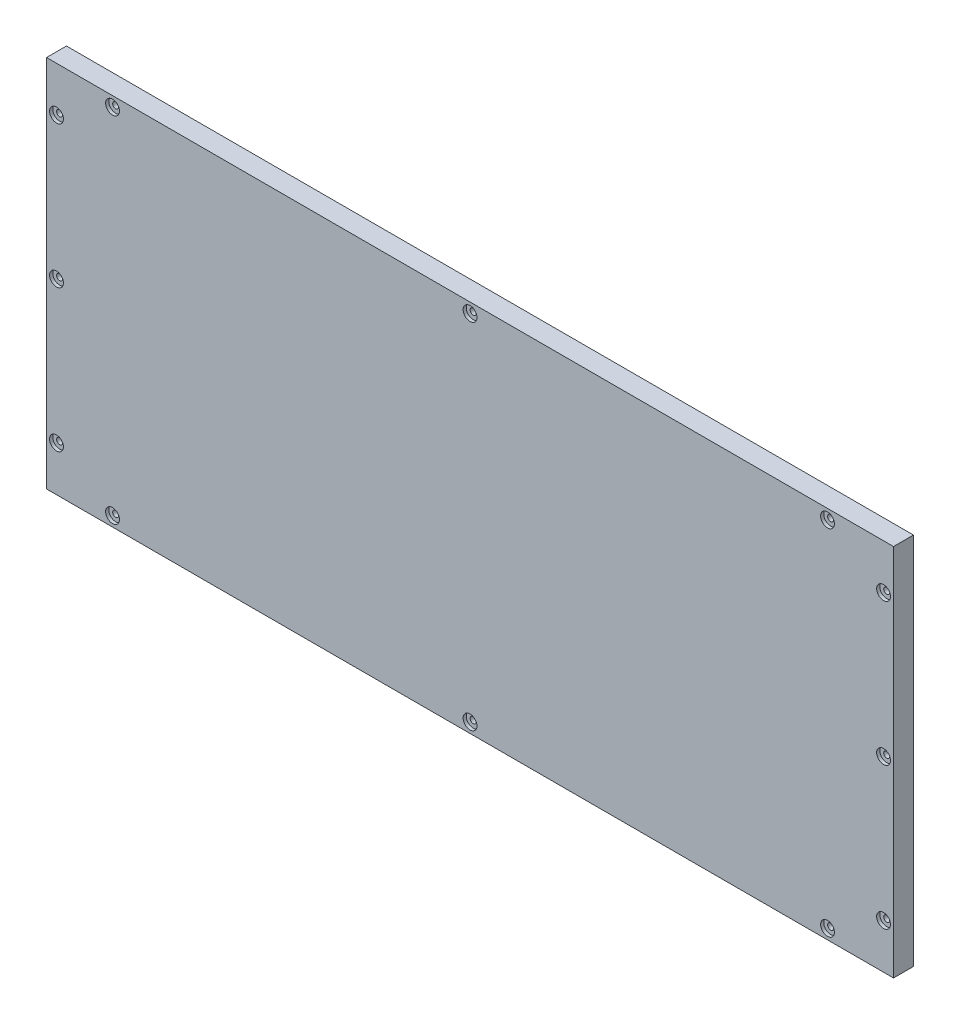
ISO-10303-21;
HEADER;
FILE_DESCRIPTION(('STEP AP214'),'2;1');
FILE_NAME('part.step','',(''),(''),'','','');
FILE_SCHEMA(('AUTOMOTIVE_DESIGN { 1 0 10303 214 1 1 1 1 }'));
ENDSEC;
DATA;
#1=APPLICATION_CONTEXT('core data for automotive mechanical design processes');
#2=APPLICATION_PROTOCOL_DEFINITION('international standard','automotive_design',2000,#1);
#3=PRODUCT_CONTEXT('',#1,'mechanical');
#4=PRODUCT('Part','Part','',(#3));
#5=PRODUCT_RELATED_PRODUCT_CATEGORY('part','',(#4));
#6=PRODUCT_DEFINITION_FORMATION('','',#4);
#7=PRODUCT_DEFINITION_CONTEXT('part definition',#1,'design');
#8=PRODUCT_DEFINITION('design','',#6,#7);
#9=PRODUCT_DEFINITION_SHAPE('','',#8);
#10=(LENGTH_UNIT() NAMED_UNIT(*) SI_UNIT(.MILLI.,.METRE.));
#11=(NAMED_UNIT(*) PLANE_ANGLE_UNIT() SI_UNIT($,.RADIAN.));
#12=(NAMED_UNIT(*) SI_UNIT($,.STERADIAN.) SOLID_ANGLE_UNIT());
#13=UNCERTAINTY_MEASURE_WITH_UNIT(LENGTH_MEASURE(1.E-05),#10,'distance_accuracy_value','');
#14=(GEOMETRIC_REPRESENTATION_CONTEXT(3) GLOBAL_UNCERTAINTY_ASSIGNED_CONTEXT((#13)) GLOBAL_UNIT_ASSIGNED_CONTEXT((#10,
#11,#12)) REPRESENTATION_CONTEXT('',''));
#15=CARTESIAN_POINT('',(0.,0.,0.));
#16=DIRECTION('',(0.,0.,1.));
#17=DIRECTION('',(1.,0.,0.));
#18=AXIS2_PLACEMENT_3D('',#15,#16,#17);
#19=CARTESIAN_POINT('',(0.,0.,8.));
#20=DIRECTION('',(1.,0.,0.));
#21=DIRECTION('',(0.,0.,-1.));
#22=AXIS2_PLACEMENT_3D('',#19,#20,#21);
#23=PLANE('',#22);
#24=DIRECTION('',(0.,-1.,0.));
#25=VECTOR('',#24,1.);
#26=CARTESIAN_POINT('',(0.,0.,0.));
#27=LINE('',#26,#25);
#28=CARTESIAN_POINT('',(0.,150.,0.));
#29=VERTEX_POINT('',#28);
#30=CARTESIAN_POINT('',(0.,0.,0.));
#31=VERTEX_POINT('',#30);
#32=EDGE_CURVE('E99',#29,#31,#27,.T.);
#33=ORIENTED_EDGE('',*,*,#32,.T.);
#34=DIRECTION('',(0.,0.,-1.));
#35=VECTOR('',#34,1.);
#36=CARTESIAN_POINT('',(0.,0.,8.));
#37=LINE('',#36,#35);
#38=CARTESIAN_POINT('',(0.,0.,8.));
#39=VERTEX_POINT('',#38);
#40=EDGE_CURVE('E11',#39,#31,#37,.T.);
#41=ORIENTED_EDGE('',*,*,#40,.F.);
#42=DIRECTION('',(0.,-1.,0.));
#43=VECTOR('',#42,1.);
#44=CARTESIAN_POINT('',(0.,0.,8.));
#45=LINE('',#44,#43);
#46=CARTESIAN_POINT('',(0.,150.,8.));
#47=VERTEX_POINT('',#46);
#48=EDGE_CURVE('E86',#47,#39,#45,.T.);
#49=ORIENTED_EDGE('',*,*,#48,.F.);
#50=DIRECTION('',(0.,0.,-1.));
#51=VECTOR('',#50,1.);
#52=CARTESIAN_POINT('',(0.,150.,8.));
#53=LINE('',#52,#51);
#54=EDGE_CURVE('E95',#47,#29,#53,.T.);
#55=ORIENTED_EDGE('',*,*,#54,.T.);
#56=EDGE_LOOP('',(#33,#41,#49,#55));
#57=FACE_BOUND('',#56,.T.);
#58=ADVANCED_FACE('F33',(#57),#23,.F.);
#59=CARTESIAN_POINT('',(0.,0.,8.));
#60=DIRECTION('',(0.,1.,0.));
#61=DIRECTION('',(0.,0.,1.));
#62=AXIS2_PLACEMENT_3D('',#59,#60,#61);
#63=PLANE('',#62);
#64=DIRECTION('',(1.,0.,0.));
#65=VECTOR('',#64,1.);
#66=CARTESIAN_POINT('',(0.,0.,0.));
#67=LINE('',#66,#65);
#68=CARTESIAN_POINT('',(340.,0.,0.));
#69=VERTEX_POINT('',#68);
#70=EDGE_CURVE('E90',#31,#69,#67,.T.);
#71=ORIENTED_EDGE('',*,*,#70,.T.);
#72=DIRECTION('',(0.,0.,-1.));
#73=VECTOR('',#72,1.);
#74=CARTESIAN_POINT('',(340.,0.,8.));
#75=LINE('',#74,#73);
#76=CARTESIAN_POINT('',(340.,0.,8.));
#77=VERTEX_POINT('',#76);
#78=EDGE_CURVE('E42',#77,#69,#75,.T.);
#79=ORIENTED_EDGE('',*,*,#78,.F.);
#80=DIRECTION('',(1.,0.,0.));
#81=VECTOR('',#80,1.);
#82=CARTESIAN_POINT('',(0.,0.,8.));
#83=LINE('',#82,#81);
#84=EDGE_CURVE('E81',#39,#77,#83,.T.);
#85=ORIENTED_EDGE('',*,*,#84,.F.);
#86=ORIENTED_EDGE('',*,*,#40,.T.);
#87=EDGE_LOOP('',(#71,#79,#85,#86));
#88=FACE_BOUND('',#87,.T.);
#89=ADVANCED_FACE('F89',(#88),#63,.F.);
#90=CARTESIAN_POINT('',(340.,0.,8.));
#91=DIRECTION('',(-1.,0.,0.));
#92=DIRECTION('',(0.,0.,1.));
#93=AXIS2_PLACEMENT_3D('',#90,#91,#92);
#94=PLANE('',#93);
#95=DIRECTION('',(0.,1.,0.));
#96=VECTOR('',#95,1.);
#97=CARTESIAN_POINT('',(340.,0.,0.));
#98=LINE('',#97,#96);
#99=CARTESIAN_POINT('',(340.,150.,0.));
#100=VERTEX_POINT('',#99);
#101=EDGE_CURVE('E68',#69,#100,#98,.T.);
#102=ORIENTED_EDGE('',*,*,#101,.T.);
#103=DIRECTION('',(0.,0.,-1.));
#104=VECTOR('',#103,1.);
#105=CARTESIAN_POINT('',(340.,150.,8.));
#106=LINE('',#105,#104);
#107=CARTESIAN_POINT('',(340.,150.,8.));
#108=VERTEX_POINT('',#107);
#109=EDGE_CURVE('E91',#108,#100,#106,.T.);
#110=ORIENTED_EDGE('',*,*,#109,.F.);
#111=DIRECTION('',(0.,1.,0.));
#112=VECTOR('',#111,1.);
#113=CARTESIAN_POINT('',(340.,0.,8.));
#114=LINE('',#113,#112);
#115=EDGE_CURVE('E84',#77,#108,#114,.T.);
#116=ORIENTED_EDGE('',*,*,#115,.F.);
#117=ORIENTED_EDGE('',*,*,#78,.T.);
#118=EDGE_LOOP('',(#102,#110,#116,#117));
#119=FACE_BOUND('',#118,.T.);
#120=ADVANCED_FACE('F93',(#119),#94,.F.);
#121=CARTESIAN_POINT('',(0.,150.,8.));
#122=DIRECTION('',(0.,-1.,0.));
#123=DIRECTION('',(0.,0.,-1.));
#124=AXIS2_PLACEMENT_3D('',#121,#122,#123);
#125=PLANE('',#124);
#126=DIRECTION('',(-1.,0.,0.));
#127=VECTOR('',#126,1.);
#128=CARTESIAN_POINT('',(0.,150.,0.));
#129=LINE('',#128,#127);
#130=EDGE_CURVE('E74',#100,#29,#129,.T.);
#131=ORIENTED_EDGE('',*,*,#130,.T.);
#132=ORIENTED_EDGE('',*,*,#54,.F.);
#133=DIRECTION('',(-1.,0.,0.));
#134=VECTOR('',#133,1.);
#135=CARTESIAN_POINT('',(0.,150.,8.));
#136=LINE('',#135,#134);
#137=EDGE_CURVE('E51',#108,#47,#136,.T.);
#138=ORIENTED_EDGE('',*,*,#137,.F.);
#139=ORIENTED_EDGE('',*,*,#109,.T.);
#140=EDGE_LOOP('',(#131,#132,#138,#139));
#141=FACE_BOUND('',#140,.T.);
#142=ADVANCED_FACE('F259',(#141),#125,.F.);
#143=CARTESIAN_POINT('',(0.,0.,8.));
#144=DIRECTION('',(0.,0.,-1.));
#145=DIRECTION('',(-1.,0.,0.));
#146=AXIS2_PLACEMENT_3D('',#143,#144,#145);
#147=PLANE('',#146);
#148=CARTESIAN_POINT('',(4.,132.,8.));
#149=DIRECTION('',(0.,0.,1.));
#150=DIRECTION('',(1.,0.,0.));
#151=AXIS2_PLACEMENT_3D('',#148,#149,#150);
#152=CIRCLE('',#151,2.77876);
#153=CARTESIAN_POINT('',(6.77876,132.,8.));
#154=VERTEX_POINT('',#153);
#155=EDGE_CURVE('E656',#154,#154,#152,.T.);
#156=ORIENTED_EDGE('',*,*,#155,.F.);
#157=EDGE_LOOP('',(#156));
#158=FACE_BOUND('',#157,.T.);
#159=CARTESIAN_POINT('',(4.00000000000001,75.,8.));
#160=DIRECTION('',(0.,0.,1.));
#161=DIRECTION('',(1.,0.,0.));
#162=AXIS2_PLACEMENT_3D('',#159,#160,#161);
#163=CIRCLE('',#162,2.77876);
#164=CARTESIAN_POINT('',(6.77876000000001,75.,8.));
#165=VERTEX_POINT('',#164);
#166=EDGE_CURVE('E170',#165,#165,#163,.T.);
#167=ORIENTED_EDGE('',*,*,#166,.F.);
#168=EDGE_LOOP('',(#167));
#169=FACE_BOUND('',#168,.T.);
#170=CARTESIAN_POINT('',(4.,18.,8.));
#171=DIRECTION('',(0.,0.,1.));
#172=DIRECTION('',(1.,0.,0.));
#173=AXIS2_PLACEMENT_3D('',#170,#171,#172);
#174=CIRCLE('',#173,2.77876);
#175=CARTESIAN_POINT('',(6.77876,18.,8.));
#176=VERTEX_POINT('',#175);
#177=EDGE_CURVE('E157',#176,#176,#174,.T.);
#178=ORIENTED_EDGE('',*,*,#177,.F.);
#179=EDGE_LOOP('',(#178));
#180=FACE_BOUND('',#179,.T.);
#181=CARTESIAN_POINT('',(26.5,4.,8.));
#182=DIRECTION('',(0.,0.,1.));
#183=DIRECTION('',(1.,0.,0.));
#184=AXIS2_PLACEMENT_3D('',#181,#182,#183);
#185=CIRCLE('',#184,2.77876);
#186=CARTESIAN_POINT('',(29.27876,4.,8.));
#187=VERTEX_POINT('',#186);
#188=EDGE_CURVE('E153',#187,#187,#185,.T.);
#189=ORIENTED_EDGE('',*,*,#188,.F.);
#190=EDGE_LOOP('',(#189));
#191=FACE_BOUND('',#190,.T.);
#192=CARTESIAN_POINT('',(170.,4.00000000000001,8.));
#193=DIRECTION('',(0.,0.,1.));
#194=DIRECTION('',(1.,0.,0.));
#195=AXIS2_PLACEMENT_3D('',#192,#193,#194);
#196=CIRCLE('',#195,2.77875999999999);
#197=CARTESIAN_POINT('',(172.77876,4.00000000000001,8.));
#198=VERTEX_POINT('',#197);
#199=EDGE_CURVE('E149',#198,#198,#196,.T.);
#200=ORIENTED_EDGE('',*,*,#199,.F.);
#201=EDGE_LOOP('',(#200));
#202=FACE_BOUND('',#201,.T.);
#203=CARTESIAN_POINT('',(313.5,4.,8.));
#204=DIRECTION('',(0.,0.,1.));
#205=DIRECTION('',(1.,0.,0.));
#206=AXIS2_PLACEMENT_3D('',#203,#204,#205);
#207=CIRCLE('',#206,2.77875999999999);
#208=CARTESIAN_POINT('',(316.27876,4.,8.));
#209=VERTEX_POINT('',#208);
#210=EDGE_CURVE('E144',#209,#209,#207,.T.);
#211=ORIENTED_EDGE('',*,*,#210,.F.);
#212=EDGE_LOOP('',(#211));
#213=FACE_BOUND('',#212,.T.);
#214=CARTESIAN_POINT('',(336.,18.,8.));
#215=DIRECTION('',(0.,0.,1.));
#216=DIRECTION('',(1.,0.,0.));
#217=AXIS2_PLACEMENT_3D('',#214,#215,#216);
#218=CIRCLE('',#217,2.77875999999999);
#219=CARTESIAN_POINT('',(338.77876,18.,8.));
#220=VERTEX_POINT('',#219);
#221=EDGE_CURVE('E139',#220,#220,#218,.T.);
#222=ORIENTED_EDGE('',*,*,#221,.F.);
#223=EDGE_LOOP('',(#222));
#224=FACE_BOUND('',#223,.T.);
#225=CARTESIAN_POINT('',(336.,75.,8.));
#226=DIRECTION('',(0.,0.,1.));
#227=DIRECTION('',(1.,0.,0.));
#228=AXIS2_PLACEMENT_3D('',#225,#226,#227);
#229=CIRCLE('',#228,2.77875999999999);
#230=CARTESIAN_POINT('',(338.77876,75.,8.));
#231=VERTEX_POINT('',#230);
#232=EDGE_CURVE('E134',#231,#231,#229,.T.);
#233=ORIENTED_EDGE('',*,*,#232,.F.);
#234=EDGE_LOOP('',(#233));
#235=FACE_BOUND('',#234,.T.);
#236=CARTESIAN_POINT('',(336.,132.,8.));
#237=DIRECTION('',(0.,0.,1.));
#238=DIRECTION('',(1.,0.,0.));
#239=AXIS2_PLACEMENT_3D('',#236,#237,#238);
#240=CIRCLE('',#239,2.77875999999999);
#241=CARTESIAN_POINT('',(338.77876,132.,8.));
#242=VERTEX_POINT('',#241);
#243=EDGE_CURVE('E129',#242,#242,#240,.T.);
#244=ORIENTED_EDGE('',*,*,#243,.F.);
#245=EDGE_LOOP('',(#244));
#246=FACE_BOUND('',#245,.T.);
#247=CARTESIAN_POINT('',(313.5,146.,8.));
#248=DIRECTION('',(0.,0.,1.));
#249=DIRECTION('',(1.,0.,0.));
#250=AXIS2_PLACEMENT_3D('',#247,#248,#249);
#251=CIRCLE('',#250,2.77875999999999);
#252=CARTESIAN_POINT('',(316.27876,146.,8.));
#253=VERTEX_POINT('',#252);
#254=EDGE_CURVE('E124',#253,#253,#251,.T.);
#255=ORIENTED_EDGE('',*,*,#254,.F.);
#256=EDGE_LOOP('',(#255));
#257=FACE_BOUND('',#256,.T.);
#258=CARTESIAN_POINT('',(170.,146.,8.));
#259=DIRECTION('',(0.,0.,1.));
#260=DIRECTION('',(1.,0.,0.));
#261=AXIS2_PLACEMENT_3D('',#258,#259,#260);
#262=CIRCLE('',#261,2.77875999999999);
#263=CARTESIAN_POINT('',(172.77876,146.,8.));
#264=VERTEX_POINT('',#263);
#265=EDGE_CURVE('E119',#264,#264,#262,.T.);
#266=ORIENTED_EDGE('',*,*,#265,.F.);
#267=EDGE_LOOP('',(#266));
#268=FACE_BOUND('',#267,.T.);
#269=CARTESIAN_POINT('',(26.5,146.,8.));
#270=DIRECTION('',(0.,0.,1.));
#271=DIRECTION('',(1.,0.,0.));
#272=AXIS2_PLACEMENT_3D('',#269,#270,#271);
#273=CIRCLE('',#272,2.77876);
#274=CARTESIAN_POINT('',(29.27876,146.,8.));
#275=VERTEX_POINT('',#274);
#276=EDGE_CURVE('E114',#275,#275,#273,.T.);
#277=ORIENTED_EDGE('',*,*,#276,.F.);
#278=EDGE_LOOP('',(#277));
#279=FACE_BOUND('',#278,.T.);
#280=ORIENTED_EDGE('',*,*,#48,.T.);
#281=ORIENTED_EDGE('',*,*,#84,.T.);
#282=ORIENTED_EDGE('',*,*,#115,.T.);
#283=ORIENTED_EDGE('',*,*,#137,.T.);
#284=EDGE_LOOP('',(#280,#281,#282,#283));
#285=FACE_BOUND('',#284,.T.);
#286=ADVANCED_FACE('F82',(#158,#169,#180,#191,#202,#213,#224,#235,#246,#257,#268,#279,#285),
#147,.F.);
#287=CARTESIAN_POINT('',(0.,0.,0.));
#288=DIRECTION('',(0.,0.,-1.));
#289=DIRECTION('',(-1.,0.,0.));
#290=AXIS2_PLACEMENT_3D('',#287,#288,#289);
#291=PLANE('',#290);
#292=CARTESIAN_POINT('',(4.,132.,0.));
#293=DIRECTION('',(0.,0.,-1.));
#294=DIRECTION('',(-1.,0.,0.));
#295=AXIS2_PLACEMENT_3D('',#292,#293,#294);
#296=CIRCLE('',#295,1.2192);
#297=CARTESIAN_POINT('',(2.78080000000001,132.,0.));
#298=VERTEX_POINT('',#297);
#299=EDGE_CURVE('E36',#298,#298,#296,.T.);
#300=ORIENTED_EDGE('',*,*,#299,.F.);
#301=EDGE_LOOP('',(#300));
#302=FACE_BOUND('',#301,.T.);
#303=CARTESIAN_POINT('',(4.00000000000001,75.,0.));
#304=DIRECTION('',(0.,0.,-1.));
#305=DIRECTION('',(-1.,0.,0.));
#306=AXIS2_PLACEMENT_3D('',#303,#304,#305);
#307=CIRCLE('',#306,1.2192);
#308=CARTESIAN_POINT('',(2.78080000000001,75.,0.));
#309=VERTEX_POINT('',#308);
#310=EDGE_CURVE('E155',#309,#309,#307,.T.);
#311=ORIENTED_EDGE('',*,*,#310,.F.);
#312=EDGE_LOOP('',(#311));
#313=FACE_BOUND('',#312,.T.);
#314=CARTESIAN_POINT('',(4.,18.,0.));
#315=DIRECTION('',(0.,0.,-1.));
#316=DIRECTION('',(-1.,0.,0.));
#317=AXIS2_PLACEMENT_3D('',#314,#315,#316);
#318=CIRCLE('',#317,1.2192);
#319=CARTESIAN_POINT('',(2.7808,18.,0.));
#320=VERTEX_POINT('',#319);
#321=EDGE_CURVE('E151',#320,#320,#318,.T.);
#322=ORIENTED_EDGE('',*,*,#321,.F.);
#323=EDGE_LOOP('',(#322));
#324=FACE_BOUND('',#323,.T.);
#325=CARTESIAN_POINT('',(26.5,4.,0.));
#326=DIRECTION('',(0.,0.,-1.));
#327=DIRECTION('',(-1.,0.,0.));
#328=AXIS2_PLACEMENT_3D('',#325,#326,#327);
#329=CIRCLE('',#328,1.2192);
#330=CARTESIAN_POINT('',(25.2808,4.,0.));
#331=VERTEX_POINT('',#330);
#332=EDGE_CURVE('E146',#331,#331,#329,.T.);
#333=ORIENTED_EDGE('',*,*,#332,.F.);
#334=EDGE_LOOP('',(#333));
#335=FACE_BOUND('',#334,.T.);
#336=CARTESIAN_POINT('',(170.,4.00000000000001,0.));
#337=DIRECTION('',(0.,0.,-1.));
#338=DIRECTION('',(-1.,0.,0.));
#339=AXIS2_PLACEMENT_3D('',#336,#337,#338);
#340=CIRCLE('',#339,1.2192);
#341=CARTESIAN_POINT('',(168.7808,4.00000000000001,0.));
#342=VERTEX_POINT('',#341);
#343=EDGE_CURVE('E141',#342,#342,#340,.T.);
#344=ORIENTED_EDGE('',*,*,#343,.F.);
#345=EDGE_LOOP('',(#344));
#346=FACE_BOUND('',#345,.T.);
#347=CARTESIAN_POINT('',(313.5,4.,0.));
#348=DIRECTION('',(0.,0.,-1.));
#349=DIRECTION('',(-1.,0.,0.));
#350=AXIS2_PLACEMENT_3D('',#347,#348,#349);
#351=CIRCLE('',#350,1.21919999999998);
#352=CARTESIAN_POINT('',(312.2808,4.,0.));
#353=VERTEX_POINT('',#352);
#354=EDGE_CURVE('E136',#353,#353,#351,.T.);
#355=ORIENTED_EDGE('',*,*,#354,.F.);
#356=EDGE_LOOP('',(#355));
#357=FACE_BOUND('',#356,.T.);
#358=CARTESIAN_POINT('',(336.,18.,0.));
#359=DIRECTION('',(0.,0.,-1.));
#360=DIRECTION('',(-1.,0.,0.));
#361=AXIS2_PLACEMENT_3D('',#358,#359,#360);
#362=CIRCLE('',#361,1.21919999999998);
#363=CARTESIAN_POINT('',(334.7808,18.,0.));
#364=VERTEX_POINT('',#363);
#365=EDGE_CURVE('E131',#364,#364,#362,.T.);
#366=ORIENTED_EDGE('',*,*,#365,.F.);
#367=EDGE_LOOP('',(#366));
#368=FACE_BOUND('',#367,.T.);
#369=CARTESIAN_POINT('',(336.,75.,0.));
#370=DIRECTION('',(0.,0.,-1.));
#371=DIRECTION('',(-1.,0.,0.));
#372=AXIS2_PLACEMENT_3D('',#369,#370,#371);
#373=CIRCLE('',#372,1.21919999999998);
#374=CARTESIAN_POINT('',(334.7808,75.,0.));
#375=VERTEX_POINT('',#374);
#376=EDGE_CURVE('E126',#375,#375,#373,.T.);
#377=ORIENTED_EDGE('',*,*,#376,.F.);
#378=EDGE_LOOP('',(#377));
#379=FACE_BOUND('',#378,.T.);
#380=CARTESIAN_POINT('',(336.,132.,0.));
#381=DIRECTION('',(0.,0.,-1.));
#382=DIRECTION('',(-1.,0.,0.));
#383=AXIS2_PLACEMENT_3D('',#380,#381,#382);
#384=CIRCLE('',#383,1.21919999999998);
#385=CARTESIAN_POINT('',(334.7808,132.,0.));
#386=VERTEX_POINT('',#385);
#387=EDGE_CURVE('E121',#386,#386,#384,.T.);
#388=ORIENTED_EDGE('',*,*,#387,.F.);
#389=EDGE_LOOP('',(#388));
#390=FACE_BOUND('',#389,.T.);
#391=CARTESIAN_POINT('',(313.5,146.,0.));
#392=DIRECTION('',(0.,0.,-1.));
#393=DIRECTION('',(-1.,0.,0.));
#394=AXIS2_PLACEMENT_3D('',#391,#392,#393);
#395=CIRCLE('',#394,1.21919999999998);
#396=CARTESIAN_POINT('',(312.2808,146.,0.));
#397=VERTEX_POINT('',#396);
#398=EDGE_CURVE('E116',#397,#397,#395,.T.);
#399=ORIENTED_EDGE('',*,*,#398,.F.);
#400=EDGE_LOOP('',(#399));
#401=FACE_BOUND('',#400,.T.);
#402=CARTESIAN_POINT('',(170.,146.,0.));
#403=DIRECTION('',(0.,0.,-1.));
#404=DIRECTION('',(-1.,0.,0.));
#405=AXIS2_PLACEMENT_3D('',#402,#403,#404);
#406=CIRCLE('',#405,1.2192);
#407=CARTESIAN_POINT('',(168.7808,146.,0.));
#408=VERTEX_POINT('',#407);
#409=EDGE_CURVE('E111',#408,#408,#406,.T.);
#410=ORIENTED_EDGE('',*,*,#409,.F.);
#411=EDGE_LOOP('',(#410));
#412=FACE_BOUND('',#411,.T.);
#413=CARTESIAN_POINT('',(26.5,146.,0.));
#414=DIRECTION('',(0.,0.,-1.));
#415=DIRECTION('',(-1.,0.,0.));
#416=AXIS2_PLACEMENT_3D('',#413,#414,#415);
#417=CIRCLE('',#416,1.2192);
#418=CARTESIAN_POINT('',(25.2808,146.,0.));
#419=VERTEX_POINT('',#418);
#420=EDGE_CURVE('E102',#419,#419,#417,.T.);
#421=ORIENTED_EDGE('',*,*,#420,.F.);
#422=EDGE_LOOP('',(#421));
#423=FACE_BOUND('',#422,.T.);
#424=ORIENTED_EDGE('',*,*,#32,.F.);
#425=ORIENTED_EDGE('',*,*,#130,.F.);
#426=ORIENTED_EDGE('',*,*,#101,.F.);
#427=ORIENTED_EDGE('',*,*,#70,.F.);
#428=EDGE_LOOP('',(#424,#425,#426,#427));
#429=FACE_BOUND('',#428,.T.);
#430=ADVANCED_FACE('F258',(#302,#313,#324,#335,#346,#357,#368,#379,#390,#401,#412,#423,#429),
#291,.T.);
#431=CARTESIAN_POINT('',(26.5,146.,8.));
#432=DIRECTION('',(0.,0.,1.));
#433=DIRECTION('',(1.,0.,0.));
#434=AXIS2_PLACEMENT_3D('',#431,#432,#433);
#435=CYLINDRICAL_SURFACE('',#434,1.2192);
#436=ORIENTED_EDGE('',*,*,#420,.T.);
#437=EDGE_LOOP('',(#436));
#438=FACE_BOUND('',#437,.T.);
#439=CARTESIAN_POINT('',(26.5,146.,6.73));
#440=DIRECTION('',(0.,0.,1.));
#441=DIRECTION('',(1.,0.,0.));
#442=AXIS2_PLACEMENT_3D('',#439,#440,#441);
#443=CIRCLE('',#442,1.2192);
#444=CARTESIAN_POINT('',(27.7192,146.,6.73));
#445=VERTEX_POINT('',#444);
#446=EDGE_CURVE('E110',#445,#445,#443,.T.);
#447=ORIENTED_EDGE('',*,*,#446,.T.);
#448=EDGE_LOOP('',(#447));
#449=FACE_BOUND('',#448,.T.);
#450=ADVANCED_FACE('F242',(#438,#449),#435,.F.);
#451=CARTESIAN_POINT('',(27.7192,146.,6.73));
#452=DIRECTION('',(0.,0.,-1.));
#453=DIRECTION('',(-1.,0.,0.));
#454=AXIS2_PLACEMENT_3D('',#451,#452,#453);
#455=PLANE('',#454);
#456=ORIENTED_EDGE('',*,*,#446,.F.);
#457=EDGE_LOOP('',(#456));
#458=FACE_BOUND('',#457,.T.);
#459=CARTESIAN_POINT('',(26.5,146.,6.73));
#460=DIRECTION('',(0.,0.,1.));
#461=DIRECTION('',(1.,0.,0.));
#462=AXIS2_PLACEMENT_3D('',#459,#460,#461);
#463=CIRCLE('',#462,2.77876);
#464=CARTESIAN_POINT('',(29.27876,146.,6.73));
#465=VERTEX_POINT('',#464);
#466=EDGE_CURVE('E236',#465,#465,#463,.T.);
#467=ORIENTED_EDGE('',*,*,#466,.T.);
#468=EDGE_LOOP('',(#467));
#469=FACE_BOUND('',#468,.T.);
#470=ADVANCED_FACE('F244',(#458,#469),#455,.F.);
#471=CARTESIAN_POINT('',(26.5,146.,8.));
#472=DIRECTION('',(0.,0.,1.));
#473=DIRECTION('',(1.,0.,0.));
#474=AXIS2_PLACEMENT_3D('',#471,#472,#473);
#475=CYLINDRICAL_SURFACE('',#474,2.77876);
#476=ORIENTED_EDGE('',*,*,#466,.F.);
#477=EDGE_LOOP('',(#476));
#478=FACE_BOUND('',#477,.T.);
#479=ORIENTED_EDGE('',*,*,#276,.T.);
#480=EDGE_LOOP('',(#479));
#481=FACE_BOUND('',#480,.T.);
#482=ADVANCED_FACE('F247',(#478,#481),#475,.F.);
#483=CARTESIAN_POINT('',(170.,146.,8.));
#484=DIRECTION('',(0.,0.,1.));
#485=DIRECTION('',(1.,0.,0.));
#486=AXIS2_PLACEMENT_3D('',#483,#484,#485);
#487=CYLINDRICAL_SURFACE('',#486,1.2192);
#488=ORIENTED_EDGE('',*,*,#409,.T.);
#489=EDGE_LOOP('',(#488));
#490=FACE_BOUND('',#489,.T.);
#491=CARTESIAN_POINT('',(170.,146.,6.73));
#492=DIRECTION('',(0.,0.,1.));
#493=DIRECTION('',(1.,0.,0.));
#494=AXIS2_PLACEMENT_3D('',#491,#492,#493);
#495=CIRCLE('',#494,1.2192);
#496=CARTESIAN_POINT('',(171.2192,146.,6.73));
#497=VERTEX_POINT('',#496);
#498=EDGE_CURVE('E115',#497,#497,#495,.T.);
#499=ORIENTED_EDGE('',*,*,#498,.T.);
#500=EDGE_LOOP('',(#499));
#501=FACE_BOUND('',#500,.T.);
#502=ADVANCED_FACE('F253',(#490,#501),#487,.F.);
#503=CARTESIAN_POINT('',(171.2192,146.,6.73));
#504=DIRECTION('',(0.,0.,-1.));
#505=DIRECTION('',(-1.,0.,0.));
#506=AXIS2_PLACEMENT_3D('',#503,#504,#505);
#507=PLANE('',#506);
#508=ORIENTED_EDGE('',*,*,#498,.F.);
#509=EDGE_LOOP('',(#508));
#510=FACE_BOUND('',#509,.T.);
#511=CARTESIAN_POINT('',(170.,146.,6.73));
#512=DIRECTION('',(0.,0.,1.));
#513=DIRECTION('',(1.,0.,0.));
#514=AXIS2_PLACEMENT_3D('',#511,#512,#513);
#515=CIRCLE('',#514,2.77875999999999);
#516=CARTESIAN_POINT('',(172.77876,146.,6.73));
#517=VERTEX_POINT('',#516);
#518=EDGE_CURVE('E229',#517,#517,#515,.T.);
#519=ORIENTED_EDGE('',*,*,#518,.T.);
#520=EDGE_LOOP('',(#519));
#521=FACE_BOUND('',#520,.T.);
#522=ADVANCED_FACE('F328',(#510,#521),#507,.F.);
#523=CARTESIAN_POINT('',(170.,146.,8.));
#524=DIRECTION('',(0.,0.,1.));
#525=DIRECTION('',(1.,0.,0.));
#526=AXIS2_PLACEMENT_3D('',#523,#524,#525);
#527=CYLINDRICAL_SURFACE('',#526,2.77875999999999);
#528=ORIENTED_EDGE('',*,*,#518,.F.);
#529=EDGE_LOOP('',(#528));
#530=FACE_BOUND('',#529,.T.);
#531=ORIENTED_EDGE('',*,*,#265,.T.);
#532=EDGE_LOOP('',(#531));
#533=FACE_BOUND('',#532,.T.);
#534=ADVANCED_FACE('F338',(#530,#533),#527,.F.);
#535=CARTESIAN_POINT('',(313.5,146.,8.));
#536=DIRECTION('',(0.,0.,1.));
#537=DIRECTION('',(1.,0.,0.));
#538=AXIS2_PLACEMENT_3D('',#535,#536,#537);
#539=CYLINDRICAL_SURFACE('',#538,1.21919999999998);
#540=ORIENTED_EDGE('',*,*,#398,.T.);
#541=EDGE_LOOP('',(#540));
#542=FACE_BOUND('',#541,.T.);
#543=CARTESIAN_POINT('',(313.5,146.,6.73));
#544=DIRECTION('',(0.,0.,1.));
#545=DIRECTION('',(1.,0.,0.));
#546=AXIS2_PLACEMENT_3D('',#543,#544,#545);
#547=CIRCLE('',#546,1.21919999999998);
#548=CARTESIAN_POINT('',(314.7192,146.,6.73));
#549=VERTEX_POINT('',#548);
#550=EDGE_CURVE('E120',#549,#549,#547,.T.);
#551=ORIENTED_EDGE('',*,*,#550,.T.);
#552=EDGE_LOOP('',(#551));
#553=FACE_BOUND('',#552,.T.);
#554=ADVANCED_FACE('F348',(#542,#553),#539,.F.);
#555=CARTESIAN_POINT('',(314.7192,146.,6.73));
#556=DIRECTION('',(0.,0.,-1.));
#557=DIRECTION('',(-1.,0.,0.));
#558=AXIS2_PLACEMENT_3D('',#555,#556,#557);
#559=PLANE('',#558);
#560=ORIENTED_EDGE('',*,*,#550,.F.);
#561=EDGE_LOOP('',(#560));
#562=FACE_BOUND('',#561,.T.);
#563=CARTESIAN_POINT('',(313.5,146.,6.73));
#564=DIRECTION('',(0.,0.,1.));
#565=DIRECTION('',(1.,0.,0.));
#566=AXIS2_PLACEMENT_3D('',#563,#564,#565);
#567=CIRCLE('',#566,2.77875999999999);
#568=CARTESIAN_POINT('',(316.27876,146.,6.73));
#569=VERTEX_POINT('',#568);
#570=EDGE_CURVE('E222',#569,#569,#567,.T.);
#571=ORIENTED_EDGE('',*,*,#570,.T.);
#572=EDGE_LOOP('',(#571));
#573=FACE_BOUND('',#572,.T.);
#574=ADVANCED_FACE('F358',(#562,#573),#559,.F.);
#575=CARTESIAN_POINT('',(313.5,146.,8.));
#576=DIRECTION('',(0.,0.,1.));
#577=DIRECTION('',(1.,0.,0.));
#578=AXIS2_PLACEMENT_3D('',#575,#576,#577);
#579=CYLINDRICAL_SURFACE('',#578,2.77875999999999);
#580=ORIENTED_EDGE('',*,*,#570,.F.);
#581=EDGE_LOOP('',(#580));
#582=FACE_BOUND('',#581,.T.);
#583=ORIENTED_EDGE('',*,*,#254,.T.);
#584=EDGE_LOOP('',(#583));
#585=FACE_BOUND('',#584,.T.);
#586=ADVANCED_FACE('F368',(#582,#585),#579,.F.);
#587=CARTESIAN_POINT('',(336.,132.,8.));
#588=DIRECTION('',(0.,0.,1.));
#589=DIRECTION('',(1.,0.,0.));
#590=AXIS2_PLACEMENT_3D('',#587,#588,#589);
#591=CYLINDRICAL_SURFACE('',#590,1.21919999999998);
#592=ORIENTED_EDGE('',*,*,#387,.T.);
#593=EDGE_LOOP('',(#592));
#594=FACE_BOUND('',#593,.T.);
#595=CARTESIAN_POINT('',(336.,132.,6.73));
#596=DIRECTION('',(0.,0.,1.));
#597=DIRECTION('',(1.,0.,0.));
#598=AXIS2_PLACEMENT_3D('',#595,#596,#597);
#599=CIRCLE('',#598,1.21919999999998);
#600=CARTESIAN_POINT('',(337.2192,132.,6.73));
#601=VERTEX_POINT('',#600);
#602=EDGE_CURVE('E125',#601,#601,#599,.T.);
#603=ORIENTED_EDGE('',*,*,#602,.T.);
#604=EDGE_LOOP('',(#603));
#605=FACE_BOUND('',#604,.T.);
#606=ADVANCED_FACE('F378',(#594,#605),#591,.F.);
#607=CARTESIAN_POINT('',(337.2192,132.,6.73));
#608=DIRECTION('',(0.,0.,-1.));
#609=DIRECTION('',(-1.,0.,0.));
#610=AXIS2_PLACEMENT_3D('',#607,#608,#609);
#611=PLANE('',#610);
#612=ORIENTED_EDGE('',*,*,#602,.F.);
#613=EDGE_LOOP('',(#612));
#614=FACE_BOUND('',#613,.T.);
#615=CARTESIAN_POINT('',(336.,132.,6.73));
#616=DIRECTION('',(0.,0.,1.));
#617=DIRECTION('',(1.,0.,0.));
#618=AXIS2_PLACEMENT_3D('',#615,#616,#617);
#619=CIRCLE('',#618,2.77875999999999);
#620=CARTESIAN_POINT('',(338.77876,132.,6.73));
#621=VERTEX_POINT('',#620);
#622=EDGE_CURVE('E215',#621,#621,#619,.T.);
#623=ORIENTED_EDGE('',*,*,#622,.T.);
#624=EDGE_LOOP('',(#623));
#625=FACE_BOUND('',#624,.T.);
#626=ADVANCED_FACE('F388',(#614,#625),#611,.F.);
#627=CARTESIAN_POINT('',(336.,132.,8.));
#628=DIRECTION('',(0.,0.,1.));
#629=DIRECTION('',(1.,0.,0.));
#630=AXIS2_PLACEMENT_3D('',#627,#628,#629);
#631=CYLINDRICAL_SURFACE('',#630,2.77875999999999);
#632=ORIENTED_EDGE('',*,*,#622,.F.);
#633=EDGE_LOOP('',(#632));
#634=FACE_BOUND('',#633,.T.);
#635=ORIENTED_EDGE('',*,*,#243,.T.);
#636=EDGE_LOOP('',(#635));
#637=FACE_BOUND('',#636,.T.);
#638=ADVANCED_FACE('F398',(#634,#637),#631,.F.);
#639=CARTESIAN_POINT('',(336.,75.,8.));
#640=DIRECTION('',(0.,0.,1.));
#641=DIRECTION('',(1.,0.,0.));
#642=AXIS2_PLACEMENT_3D('',#639,#640,#641);
#643=CYLINDRICAL_SURFACE('',#642,1.21919999999998);
#644=ORIENTED_EDGE('',*,*,#376,.T.);
#645=EDGE_LOOP('',(#644));
#646=FACE_BOUND('',#645,.T.);
#647=CARTESIAN_POINT('',(336.,75.,6.73));
#648=DIRECTION('',(0.,0.,1.));
#649=DIRECTION('',(1.,0.,0.));
#650=AXIS2_PLACEMENT_3D('',#647,#648,#649);
#651=CIRCLE('',#650,1.21919999999998);
#652=CARTESIAN_POINT('',(337.2192,75.,6.73));
#653=VERTEX_POINT('',#652);
#654=EDGE_CURVE('E130',#653,#653,#651,.T.);
#655=ORIENTED_EDGE('',*,*,#654,.T.);
#656=EDGE_LOOP('',(#655));
#657=FACE_BOUND('',#656,.T.);
#658=ADVANCED_FACE('F408',(#646,#657),#643,.F.);
#659=CARTESIAN_POINT('',(337.2192,75.,6.73));
#660=DIRECTION('',(0.,0.,-1.));
#661=DIRECTION('',(-1.,0.,0.));
#662=AXIS2_PLACEMENT_3D('',#659,#660,#661);
#663=PLANE('',#662);
#664=ORIENTED_EDGE('',*,*,#654,.F.);
#665=EDGE_LOOP('',(#664));
#666=FACE_BOUND('',#665,.T.);
#667=CARTESIAN_POINT('',(336.,75.,6.73));
#668=DIRECTION('',(0.,0.,1.));
#669=DIRECTION('',(1.,0.,0.));
#670=AXIS2_PLACEMENT_3D('',#667,#668,#669);
#671=CIRCLE('',#670,2.77875999999999);
#672=CARTESIAN_POINT('',(338.77876,75.,6.73));
#673=VERTEX_POINT('',#672);
#674=EDGE_CURVE('E208',#673,#673,#671,.T.);
#675=ORIENTED_EDGE('',*,*,#674,.T.);
#676=EDGE_LOOP('',(#675));
#677=FACE_BOUND('',#676,.T.);
#678=ADVANCED_FACE('F418',(#666,#677),#663,.F.);
#679=CARTESIAN_POINT('',(336.,75.,8.));
#680=DIRECTION('',(0.,0.,1.));
#681=DIRECTION('',(1.,0.,0.));
#682=AXIS2_PLACEMENT_3D('',#679,#680,#681);
#683=CYLINDRICAL_SURFACE('',#682,2.77875999999999);
#684=ORIENTED_EDGE('',*,*,#674,.F.);
#685=EDGE_LOOP('',(#684));
#686=FACE_BOUND('',#685,.T.);
#687=ORIENTED_EDGE('',*,*,#232,.T.);
#688=EDGE_LOOP('',(#687));
#689=FACE_BOUND('',#688,.T.);
#690=ADVANCED_FACE('F428',(#686,#689),#683,.F.);
#691=CARTESIAN_POINT('',(336.,18.,8.));
#692=DIRECTION('',(0.,0.,1.));
#693=DIRECTION('',(1.,0.,0.));
#694=AXIS2_PLACEMENT_3D('',#691,#692,#693);
#695=CYLINDRICAL_SURFACE('',#694,1.21919999999998);
#696=ORIENTED_EDGE('',*,*,#365,.T.);
#697=EDGE_LOOP('',(#696));
#698=FACE_BOUND('',#697,.T.);
#699=CARTESIAN_POINT('',(336.,18.,6.73));
#700=DIRECTION('',(0.,0.,1.));
#701=DIRECTION('',(1.,0.,0.));
#702=AXIS2_PLACEMENT_3D('',#699,#700,#701);
#703=CIRCLE('',#702,1.21919999999998);
#704=CARTESIAN_POINT('',(337.2192,18.,6.73));
#705=VERTEX_POINT('',#704);
#706=EDGE_CURVE('E135',#705,#705,#703,.T.);
#707=ORIENTED_EDGE('',*,*,#706,.T.);
#708=EDGE_LOOP('',(#707));
#709=FACE_BOUND('',#708,.T.);
#710=ADVANCED_FACE('F438',(#698,#709),#695,.F.);
#711=CARTESIAN_POINT('',(337.2192,18.,6.73));
#712=DIRECTION('',(0.,0.,-1.));
#713=DIRECTION('',(-1.,0.,0.));
#714=AXIS2_PLACEMENT_3D('',#711,#712,#713);
#715=PLANE('',#714);
#716=ORIENTED_EDGE('',*,*,#706,.F.);
#717=EDGE_LOOP('',(#716));
#718=FACE_BOUND('',#717,.T.);
#719=CARTESIAN_POINT('',(336.,18.,6.73));
#720=DIRECTION('',(0.,0.,1.));
#721=DIRECTION('',(1.,0.,0.));
#722=AXIS2_PLACEMENT_3D('',#719,#720,#721);
#723=CIRCLE('',#722,2.77875999999999);
#724=CARTESIAN_POINT('',(338.77876,18.,6.73));
#725=VERTEX_POINT('',#724);
#726=EDGE_CURVE('E201',#725,#725,#723,.T.);
#727=ORIENTED_EDGE('',*,*,#726,.T.);
#728=EDGE_LOOP('',(#727));
#729=FACE_BOUND('',#728,.T.);
#730=ADVANCED_FACE('F448',(#718,#729),#715,.F.);
#731=CARTESIAN_POINT('',(336.,18.,8.));
#732=DIRECTION('',(0.,0.,1.));
#733=DIRECTION('',(1.,0.,0.));
#734=AXIS2_PLACEMENT_3D('',#731,#732,#733);
#735=CYLINDRICAL_SURFACE('',#734,2.77875999999999);
#736=ORIENTED_EDGE('',*,*,#726,.F.);
#737=EDGE_LOOP('',(#736));
#738=FACE_BOUND('',#737,.T.);
#739=ORIENTED_EDGE('',*,*,#221,.T.);
#740=EDGE_LOOP('',(#739));
#741=FACE_BOUND('',#740,.T.);
#742=ADVANCED_FACE('F458',(#738,#741),#735,.F.);
#743=CARTESIAN_POINT('',(313.5,4.,8.));
#744=DIRECTION('',(0.,0.,1.));
#745=DIRECTION('',(1.,0.,0.));
#746=AXIS2_PLACEMENT_3D('',#743,#744,#745);
#747=CYLINDRICAL_SURFACE('',#746,1.21919999999998);
#748=ORIENTED_EDGE('',*,*,#354,.T.);
#749=EDGE_LOOP('',(#748));
#750=FACE_BOUND('',#749,.T.);
#751=CARTESIAN_POINT('',(313.5,4.,6.73));
#752=DIRECTION('',(0.,0.,1.));
#753=DIRECTION('',(1.,0.,0.));
#754=AXIS2_PLACEMENT_3D('',#751,#752,#753);
#755=CIRCLE('',#754,1.21919999999998);
#756=CARTESIAN_POINT('',(314.7192,4.,6.73));
#757=VERTEX_POINT('',#756);
#758=EDGE_CURVE('E140',#757,#757,#755,.T.);
#759=ORIENTED_EDGE('',*,*,#758,.T.);
#760=EDGE_LOOP('',(#759));
#761=FACE_BOUND('',#760,.T.);
#762=ADVANCED_FACE('F468',(#750,#761),#747,.F.);
#763=CARTESIAN_POINT('',(314.7192,4.,6.73));
#764=DIRECTION('',(0.,0.,-1.));
#765=DIRECTION('',(-1.,0.,0.));
#766=AXIS2_PLACEMENT_3D('',#763,#764,#765);
#767=PLANE('',#766);
#768=ORIENTED_EDGE('',*,*,#758,.F.);
#769=EDGE_LOOP('',(#768));
#770=FACE_BOUND('',#769,.T.);
#771=CARTESIAN_POINT('',(313.5,4.,6.73));
#772=DIRECTION('',(0.,0.,1.));
#773=DIRECTION('',(1.,0.,0.));
#774=AXIS2_PLACEMENT_3D('',#771,#772,#773);
#775=CIRCLE('',#774,2.77875999999999);
#776=CARTESIAN_POINT('',(316.27876,4.,6.73));
#777=VERTEX_POINT('',#776);
#778=EDGE_CURVE('E194',#777,#777,#775,.T.);
#779=ORIENTED_EDGE('',*,*,#778,.T.);
#780=EDGE_LOOP('',(#779));
#781=FACE_BOUND('',#780,.T.);
#782=ADVANCED_FACE('F478',(#770,#781),#767,.F.);
#783=CARTESIAN_POINT('',(313.5,4.,8.));
#784=DIRECTION('',(0.,0.,1.));
#785=DIRECTION('',(1.,0.,0.));
#786=AXIS2_PLACEMENT_3D('',#783,#784,#785);
#787=CYLINDRICAL_SURFACE('',#786,2.77875999999999);
#788=ORIENTED_EDGE('',*,*,#778,.F.);
#789=EDGE_LOOP('',(#788));
#790=FACE_BOUND('',#789,.T.);
#791=ORIENTED_EDGE('',*,*,#210,.T.);
#792=EDGE_LOOP('',(#791));
#793=FACE_BOUND('',#792,.T.);
#794=ADVANCED_FACE('F488',(#790,#793),#787,.F.);
#795=CARTESIAN_POINT('',(170.,4.00000000000001,8.));
#796=DIRECTION('',(0.,0.,1.));
#797=DIRECTION('',(1.,0.,0.));
#798=AXIS2_PLACEMENT_3D('',#795,#796,#797);
#799=CYLINDRICAL_SURFACE('',#798,1.2192);
#800=ORIENTED_EDGE('',*,*,#343,.T.);
#801=EDGE_LOOP('',(#800));
#802=FACE_BOUND('',#801,.T.);
#803=CARTESIAN_POINT('',(170.,4.00000000000001,6.73));
#804=DIRECTION('',(0.,0.,1.));
#805=DIRECTION('',(1.,0.,0.));
#806=AXIS2_PLACEMENT_3D('',#803,#804,#805);
#807=CIRCLE('',#806,1.2192);
#808=CARTESIAN_POINT('',(171.2192,4.00000000000001,6.73));
#809=VERTEX_POINT('',#808);
#810=EDGE_CURVE('E145',#809,#809,#807,.T.);
#811=ORIENTED_EDGE('',*,*,#810,.T.);
#812=EDGE_LOOP('',(#811));
#813=FACE_BOUND('',#812,.T.);
#814=ADVANCED_FACE('F498',(#802,#813),#799,.F.);
#815=CARTESIAN_POINT('',(171.2192,4.00000000000001,6.73));
#816=DIRECTION('',(0.,0.,-1.));
#817=DIRECTION('',(-1.,0.,0.));
#818=AXIS2_PLACEMENT_3D('',#815,#816,#817);
#819=PLANE('',#818);
#820=ORIENTED_EDGE('',*,*,#810,.F.);
#821=EDGE_LOOP('',(#820));
#822=FACE_BOUND('',#821,.T.);
#823=CARTESIAN_POINT('',(170.,4.00000000000001,6.73));
#824=DIRECTION('',(0.,0.,1.));
#825=DIRECTION('',(1.,0.,0.));
#826=AXIS2_PLACEMENT_3D('',#823,#824,#825);
#827=CIRCLE('',#826,2.77875999999999);
#828=CARTESIAN_POINT('',(172.77876,4.00000000000001,6.73));
#829=VERTEX_POINT('',#828);
#830=EDGE_CURVE('E187',#829,#829,#827,.T.);
#831=ORIENTED_EDGE('',*,*,#830,.T.);
#832=EDGE_LOOP('',(#831));
#833=FACE_BOUND('',#832,.T.);
#834=ADVANCED_FACE('F508',(#822,#833),#819,.F.);
#835=CARTESIAN_POINT('',(170.,4.00000000000001,8.));
#836=DIRECTION('',(0.,0.,1.));
#837=DIRECTION('',(1.,0.,0.));
#838=AXIS2_PLACEMENT_3D('',#835,#836,#837);
#839=CYLINDRICAL_SURFACE('',#838,2.77875999999999);
#840=ORIENTED_EDGE('',*,*,#830,.F.);
#841=EDGE_LOOP('',(#840));
#842=FACE_BOUND('',#841,.T.);
#843=ORIENTED_EDGE('',*,*,#199,.T.);
#844=EDGE_LOOP('',(#843));
#845=FACE_BOUND('',#844,.T.);
#846=ADVANCED_FACE('F518',(#842,#845),#839,.F.);
#847=CARTESIAN_POINT('',(26.5,4.,8.));
#848=DIRECTION('',(0.,0.,1.));
#849=DIRECTION('',(1.,0.,0.));
#850=AXIS2_PLACEMENT_3D('',#847,#848,#849);
#851=CYLINDRICAL_SURFACE('',#850,1.2192);
#852=ORIENTED_EDGE('',*,*,#332,.T.);
#853=EDGE_LOOP('',(#852));
#854=FACE_BOUND('',#853,.T.);
#855=CARTESIAN_POINT('',(26.5,4.,6.73));
#856=DIRECTION('',(0.,0.,1.));
#857=DIRECTION('',(1.,0.,0.));
#858=AXIS2_PLACEMENT_3D('',#855,#856,#857);
#859=CIRCLE('',#858,1.2192);
#860=CARTESIAN_POINT('',(27.7192,4.,6.73));
#861=VERTEX_POINT('',#860);
#862=EDGE_CURVE('E150',#861,#861,#859,.T.);
#863=ORIENTED_EDGE('',*,*,#862,.T.);
#864=EDGE_LOOP('',(#863));
#865=FACE_BOUND('',#864,.T.);
#866=ADVANCED_FACE('F528',(#854,#865),#851,.F.);
#867=CARTESIAN_POINT('',(27.7192,4.,6.73));
#868=DIRECTION('',(0.,0.,-1.));
#869=DIRECTION('',(-1.,0.,0.));
#870=AXIS2_PLACEMENT_3D('',#867,#868,#869);
#871=PLANE('',#870);
#872=ORIENTED_EDGE('',*,*,#862,.F.);
#873=EDGE_LOOP('',(#872));
#874=FACE_BOUND('',#873,.T.);
#875=CARTESIAN_POINT('',(26.5,4.,6.73));
#876=DIRECTION('',(0.,0.,1.));
#877=DIRECTION('',(1.,0.,0.));
#878=AXIS2_PLACEMENT_3D('',#875,#876,#877);
#879=CIRCLE('',#878,2.77876);
#880=CARTESIAN_POINT('',(29.27876,4.,6.73));
#881=VERTEX_POINT('',#880);
#882=EDGE_CURVE('E180',#881,#881,#879,.T.);
#883=ORIENTED_EDGE('',*,*,#882,.T.);
#884=EDGE_LOOP('',(#883));
#885=FACE_BOUND('',#884,.T.);
#886=ADVANCED_FACE('F538',(#874,#885),#871,.F.);
#887=CARTESIAN_POINT('',(26.5,4.,8.));
#888=DIRECTION('',(0.,0.,1.));
#889=DIRECTION('',(1.,0.,0.));
#890=AXIS2_PLACEMENT_3D('',#887,#888,#889);
#891=CYLINDRICAL_SURFACE('',#890,2.77876);
#892=ORIENTED_EDGE('',*,*,#882,.F.);
#893=EDGE_LOOP('',(#892));
#894=FACE_BOUND('',#893,.T.);
#895=ORIENTED_EDGE('',*,*,#188,.T.);
#896=EDGE_LOOP('',(#895));
#897=FACE_BOUND('',#896,.T.);
#898=ADVANCED_FACE('F548',(#894,#897),#891,.F.);
#899=CARTESIAN_POINT('',(4.,18.,8.));
#900=DIRECTION('',(0.,0.,1.));
#901=DIRECTION('',(1.,0.,0.));
#902=AXIS2_PLACEMENT_3D('',#899,#900,#901);
#903=CYLINDRICAL_SURFACE('',#902,1.2192);
#904=ORIENTED_EDGE('',*,*,#321,.T.);
#905=EDGE_LOOP('',(#904));
#906=FACE_BOUND('',#905,.T.);
#907=CARTESIAN_POINT('',(4.,18.,6.73));
#908=DIRECTION('',(0.,0.,1.));
#909=DIRECTION('',(1.,0.,0.));
#910=AXIS2_PLACEMENT_3D('',#907,#908,#909);
#911=CIRCLE('',#910,1.2192);
#912=CARTESIAN_POINT('',(5.2192,18.,6.73));
#913=VERTEX_POINT('',#912);
#914=EDGE_CURVE('E154',#913,#913,#911,.T.);
#915=ORIENTED_EDGE('',*,*,#914,.T.);
#916=EDGE_LOOP('',(#915));
#917=FACE_BOUND('',#916,.T.);
#918=ADVANCED_FACE('F558',(#906,#917),#903,.F.);
#919=CARTESIAN_POINT('',(5.2192,18.,6.73));
#920=DIRECTION('',(0.,0.,-1.));
#921=DIRECTION('',(-1.,0.,0.));
#922=AXIS2_PLACEMENT_3D('',#919,#920,#921);
#923=PLANE('',#922);
#924=ORIENTED_EDGE('',*,*,#914,.F.);
#925=EDGE_LOOP('',(#924));
#926=FACE_BOUND('',#925,.T.);
#927=CARTESIAN_POINT('',(4.,18.,6.73));
#928=DIRECTION('',(0.,0.,1.));
#929=DIRECTION('',(1.,0.,0.));
#930=AXIS2_PLACEMENT_3D('',#927,#928,#929);
#931=CIRCLE('',#930,2.77876);
#932=CARTESIAN_POINT('',(6.77876,18.,6.73));
#933=VERTEX_POINT('',#932);
#934=EDGE_CURVE('E162',#933,#933,#931,.T.);
#935=ORIENTED_EDGE('',*,*,#934,.T.);
#936=EDGE_LOOP('',(#935));
#937=FACE_BOUND('',#936,.T.);
#938=ADVANCED_FACE('F568',(#926,#937),#923,.F.);
#939=CARTESIAN_POINT('',(4.,18.,8.));
#940=DIRECTION('',(0.,0.,1.));
#941=DIRECTION('',(1.,0.,0.));
#942=AXIS2_PLACEMENT_3D('',#939,#940,#941);
#943=CYLINDRICAL_SURFACE('',#942,2.77876);
#944=ORIENTED_EDGE('',*,*,#934,.F.);
#945=EDGE_LOOP('',(#944));
#946=FACE_BOUND('',#945,.T.);
#947=ORIENTED_EDGE('',*,*,#177,.T.);
#948=EDGE_LOOP('',(#947));
#949=FACE_BOUND('',#948,.T.);
#950=ADVANCED_FACE('F578',(#946,#949),#943,.F.);
#951=CARTESIAN_POINT('',(4.00000000000001,75.,8.));
#952=DIRECTION('',(0.,0.,1.));
#953=DIRECTION('',(1.,0.,0.));
#954=AXIS2_PLACEMENT_3D('',#951,#952,#953);
#955=CYLINDRICAL_SURFACE('',#954,1.2192);
#956=ORIENTED_EDGE('',*,*,#310,.T.);
#957=EDGE_LOOP('',(#956));
#958=FACE_BOUND('',#957,.T.);
#959=CARTESIAN_POINT('',(4.00000000000001,75.,6.73));
#960=DIRECTION('',(0.,0.,1.));
#961=DIRECTION('',(1.,0.,0.));
#962=AXIS2_PLACEMENT_3D('',#959,#960,#961);
#963=CIRCLE('',#962,1.2192);
#964=CARTESIAN_POINT('',(5.21920000000001,75.,6.73));
#965=VERTEX_POINT('',#964);
#966=EDGE_CURVE('E158',#965,#965,#963,.T.);
#967=ORIENTED_EDGE('',*,*,#966,.T.);
#968=EDGE_LOOP('',(#967));
#969=FACE_BOUND('',#968,.T.);
#970=ADVANCED_FACE('F588',(#958,#969),#955,.F.);
#971=CARTESIAN_POINT('',(5.21920000000001,75.,6.73));
#972=DIRECTION('',(0.,0.,-1.));
#973=DIRECTION('',(-1.,0.,0.));
#974=AXIS2_PLACEMENT_3D('',#971,#972,#973);
#975=PLANE('',#974);
#976=ORIENTED_EDGE('',*,*,#966,.F.);
#977=EDGE_LOOP('',(#976));
#978=FACE_BOUND('',#977,.T.);
#979=CARTESIAN_POINT('',(4.00000000000001,75.,6.73));
#980=DIRECTION('',(0.,0.,1.));
#981=DIRECTION('',(1.,0.,0.));
#982=AXIS2_PLACEMENT_3D('',#979,#980,#981);
#983=CIRCLE('',#982,2.77876);
#984=CARTESIAN_POINT('',(6.77876000000001,75.,6.73));
#985=VERTEX_POINT('',#984);
#986=EDGE_CURVE('E165',#985,#985,#983,.T.);
#987=ORIENTED_EDGE('',*,*,#986,.T.);
#988=EDGE_LOOP('',(#987));
#989=FACE_BOUND('',#988,.T.);
#990=ADVANCED_FACE('F598',(#978,#989),#975,.F.);
#991=CARTESIAN_POINT('',(4.00000000000001,75.,8.));
#992=DIRECTION('',(0.,0.,1.));
#993=DIRECTION('',(1.,0.,0.));
#994=AXIS2_PLACEMENT_3D('',#991,#992,#993);
#995=CYLINDRICAL_SURFACE('',#994,2.77876);
#996=ORIENTED_EDGE('',*,*,#986,.F.);
#997=EDGE_LOOP('',(#996));
#998=FACE_BOUND('',#997,.T.);
#999=ORIENTED_EDGE('',*,*,#166,.T.);
#1000=EDGE_LOOP('',(#999));
#1001=FACE_BOUND('',#1000,.T.);
#1002=ADVANCED_FACE('F607',(#998,#1001),#995,.F.);
#1003=CARTESIAN_POINT('',(4.,132.,8.));
#1004=DIRECTION('',(0.,0.,1.));
#1005=DIRECTION('',(1.,0.,0.));
#1006=AXIS2_PLACEMENT_3D('',#1003,#1004,#1005);
#1007=CYLINDRICAL_SURFACE('',#1006,1.2192);
#1008=ORIENTED_EDGE('',*,*,#299,.T.);
#1009=EDGE_LOOP('',(#1008));
#1010=FACE_BOUND('',#1009,.T.);
#1011=CARTESIAN_POINT('',(4.,132.,6.73));
#1012=DIRECTION('',(0.,0.,1.));
#1013=DIRECTION('',(1.,0.,0.));
#1014=AXIS2_PLACEMENT_3D('',#1011,#1012,#1013);
#1015=CIRCLE('',#1014,1.2192);
#1016=CARTESIAN_POINT('',(5.2192,132.,6.73));
#1017=VERTEX_POINT('',#1016);
#1018=EDGE_CURVE('E658',#1017,#1017,#1015,.T.);
#1019=ORIENTED_EDGE('',*,*,#1018,.T.);
#1020=EDGE_LOOP('',(#1019));
#1021=FACE_BOUND('',#1020,.T.);
#1022=ADVANCED_FACE('F617',(#1010,#1021),#1007,.F.);
#1023=CARTESIAN_POINT('',(5.2192,132.,6.73));
#1024=DIRECTION('',(0.,0.,-1.));
#1025=DIRECTION('',(-1.,0.,0.));
#1026=AXIS2_PLACEMENT_3D('',#1023,#1024,#1025);
#1027=PLANE('',#1026);
#1028=ORIENTED_EDGE('',*,*,#1018,.F.);
#1029=EDGE_LOOP('',(#1028));
#1030=FACE_BOUND('',#1029,.T.);
#1031=CARTESIAN_POINT('',(4.,132.,6.73));
#1032=DIRECTION('',(0.,0.,1.));
#1033=DIRECTION('',(1.,0.,0.));
#1034=AXIS2_PLACEMENT_3D('',#1031,#1032,#1033);
#1035=CIRCLE('',#1034,2.77876);
#1036=CARTESIAN_POINT('',(6.77876,132.,6.73));
#1037=VERTEX_POINT('',#1036);
#1038=EDGE_CURVE('E654',#1037,#1037,#1035,.T.);
#1039=ORIENTED_EDGE('',*,*,#1038,.T.);
#1040=EDGE_LOOP('',(#1039));
#1041=FACE_BOUND('',#1040,.T.);
#1042=ADVANCED_FACE('F627',(#1030,#1041),#1027,.F.);
#1043=CARTESIAN_POINT('',(4.,132.,8.));
#1044=DIRECTION('',(0.,0.,1.));
#1045=DIRECTION('',(1.,0.,0.));
#1046=AXIS2_PLACEMENT_3D('',#1043,#1044,#1045);
#1047=CYLINDRICAL_SURFACE('',#1046,2.77876);
#1048=ORIENTED_EDGE('',*,*,#1038,.F.);
#1049=EDGE_LOOP('',(#1048));
#1050=FACE_BOUND('',#1049,.T.);
#1051=ORIENTED_EDGE('',*,*,#155,.T.);
#1052=EDGE_LOOP('',(#1051));
#1053=FACE_BOUND('',#1052,.T.);
#1054=ADVANCED_FACE('F637',(#1050,#1053),#1047,.F.);
#1055=CLOSED_SHELL('',(#58,#89,#120,#142,#286,#430,#450,#470,#482,#502,#522,#534,#554,#574,#586,
#606,#626,#638,#658,#678,#690,#710,#730,#742,#762,#782,#794,#814,#834,#846,#866,#886,#898,#918,
#938,#950,#970,#990,#1002,#1022,#1042,#1054));
#1056=MANIFOLD_SOLID_BREP('B2',#1055);
#1057=ADVANCED_BREP_SHAPE_REPRESENTATION('',(#18,#1056),#14);
#1058=SHAPE_DEFINITION_REPRESENTATION(#9,#1057);
ENDSEC;
END-ISO-10303-21;
